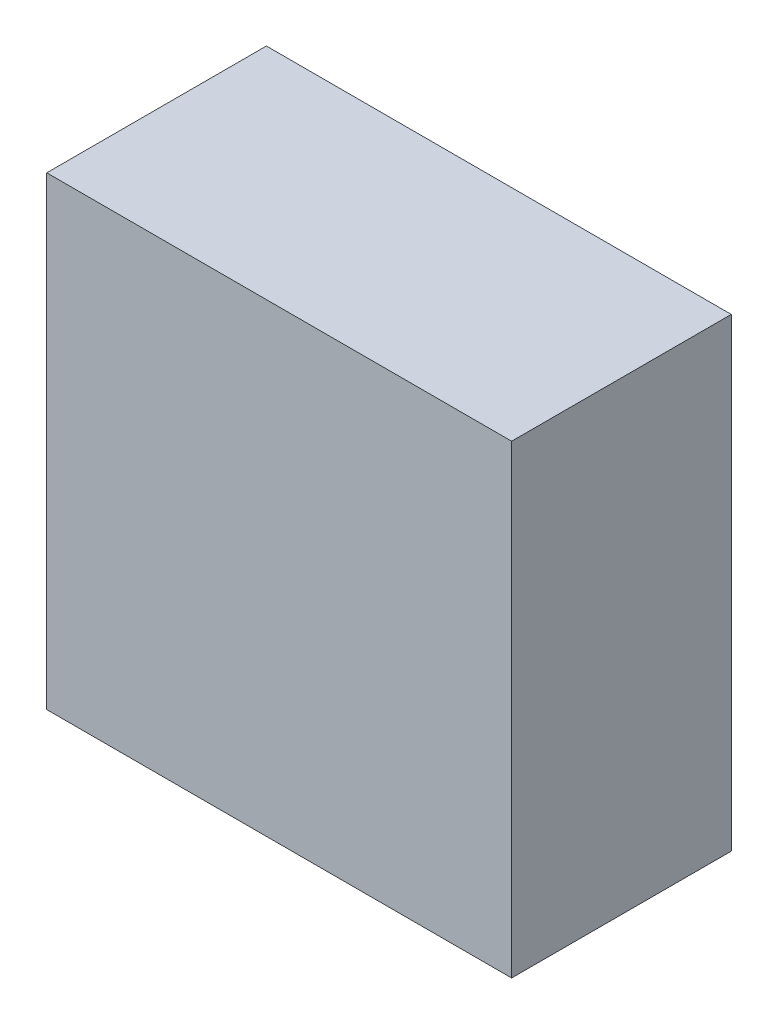
ISO-10303-21;
HEADER;
FILE_DESCRIPTION(('STEP AP214'),'2;1');
FILE_NAME('part.step','',(''),(''),'','','');
FILE_SCHEMA(('AUTOMOTIVE_DESIGN { 1 0 10303 214 1 1 1 1 }'));
ENDSEC;
DATA;
#1=APPLICATION_CONTEXT('core data for automotive mechanical design processes');
#2=APPLICATION_PROTOCOL_DEFINITION('international standard','automotive_design',2000,#1);
#3=PRODUCT_CONTEXT('',#1,'mechanical');
#4=PRODUCT('Part','Part','',(#3));
#5=PRODUCT_RELATED_PRODUCT_CATEGORY('part','',(#4));
#6=PRODUCT_DEFINITION_FORMATION('','',#4);
#7=PRODUCT_DEFINITION_CONTEXT('part definition',#1,'design');
#8=PRODUCT_DEFINITION('design','',#6,#7);
#9=PRODUCT_DEFINITION_SHAPE('','',#8);
#10=(LENGTH_UNIT() NAMED_UNIT(*) SI_UNIT(.MILLI.,.METRE.));
#11=(NAMED_UNIT(*) PLANE_ANGLE_UNIT() SI_UNIT($,.RADIAN.));
#12=(NAMED_UNIT(*) SI_UNIT($,.STERADIAN.) SOLID_ANGLE_UNIT());
#13=UNCERTAINTY_MEASURE_WITH_UNIT(LENGTH_MEASURE(1.E-05),#10,'distance_accuracy_value','');
#14=(GEOMETRIC_REPRESENTATION_CONTEXT(3) GLOBAL_UNCERTAINTY_ASSIGNED_CONTEXT((#13)) GLOBAL_UNIT_ASSIGNED_CONTEXT((#10,
#11,#12)) REPRESENTATION_CONTEXT('',''));
#15=CARTESIAN_POINT('',(0.,0.,0.));
#16=DIRECTION('',(0.,0.,1.));
#17=DIRECTION('',(1.,0.,0.));
#18=AXIS2_PLACEMENT_3D('',#15,#16,#17);
#19=CARTESIAN_POINT('',(-9.6495162385987,6.98598467880865,4.30903114393277));
#20=DIRECTION('',(1.,0.,0.));
#21=DIRECTION('',(0.,0.,-1.));
#22=AXIS2_PLACEMENT_3D('',#19,#20,#21);
#23=PLANE('',#22);
#24=DIRECTION('',(0.,-1.,0.));
#25=VECTOR('',#24,1.);
#26=CARTESIAN_POINT('',(-9.6495162385987,6.98598467880865,-1.69096885606723));
#27=LINE('',#26,#25);
#28=CARTESIAN_POINT('',(-9.6495162385987,6.98598467880865,-1.69096885606723));
#29=VERTEX_POINT('',#28);
#30=CARTESIAN_POINT('',(-9.6495162385987,-5.71401532119135,-1.69096885606723));
#31=VERTEX_POINT('',#30);
#32=EDGE_CURVE('E79',#29,#31,#27,.T.);
#33=ORIENTED_EDGE('',*,*,#32,.T.);
#34=DIRECTION('',(0.,0.,-1.));
#35=VECTOR('',#34,1.);
#36=CARTESIAN_POINT('',(-9.6495162385987,-5.71401532119135,4.30903114393277));
#37=LINE('',#36,#35);
#38=CARTESIAN_POINT('',(-9.6495162385987,-5.71401532119135,4.30903114393277));
#39=VERTEX_POINT('',#38);
#40=EDGE_CURVE('E11',#39,#31,#37,.T.);
#41=ORIENTED_EDGE('',*,*,#40,.F.);
#42=DIRECTION('',(0.,-1.,0.));
#43=VECTOR('',#42,1.);
#44=CARTESIAN_POINT('',(-9.6495162385987,6.98598467880865,4.30903114393277));
#45=LINE('',#44,#43);
#46=CARTESIAN_POINT('',(-9.6495162385987,6.98598467880865,4.30903114393277));
#47=VERTEX_POINT('',#46);
#48=EDGE_CURVE('E67',#47,#39,#45,.T.);
#49=ORIENTED_EDGE('',*,*,#48,.F.);
#50=DIRECTION('',(0.,0.,-1.));
#51=VECTOR('',#50,1.);
#52=CARTESIAN_POINT('',(-9.6495162385987,6.98598467880865,4.30903114393277));
#53=LINE('',#52,#51);
#54=EDGE_CURVE('E75',#47,#29,#53,.T.);
#55=ORIENTED_EDGE('',*,*,#54,.T.);
#56=EDGE_LOOP('',(#33,#41,#49,#55));
#57=FACE_BOUND('',#56,.T.);
#58=ADVANCED_FACE('F16',(#57),#23,.F.);
#59=CARTESIAN_POINT('',(-9.6495162385987,-5.71401532119135,4.30903114393277));
#60=DIRECTION('',(0.,1.,0.));
#61=DIRECTION('',(-1.,0.,0.));
#62=AXIS2_PLACEMENT_3D('',#59,#60,#61);
#63=PLANE('',#62);
#64=DIRECTION('',(1.,0.,0.));
#65=VECTOR('',#64,1.);
#66=CARTESIAN_POINT('',(-9.6495162385987,-5.71401532119135,-1.69096885606723));
#67=LINE('',#66,#65);
#68=CARTESIAN_POINT('',(3.0504837614013,-5.71401532119134,-1.69096885606723));
#69=VERTEX_POINT('',#68);
#70=EDGE_CURVE('E71',#31,#69,#67,.T.);
#71=ORIENTED_EDGE('',*,*,#70,.T.);
#72=DIRECTION('',(0.,0.,-1.));
#73=VECTOR('',#72,1.);
#74=CARTESIAN_POINT('',(3.0504837614013,-5.71401532119134,4.30903114393277));
#75=LINE('',#74,#73);
#76=CARTESIAN_POINT('',(3.0504837614013,-5.71401532119134,4.30903114393277));
#77=VERTEX_POINT('',#76);
#78=EDGE_CURVE('E24',#77,#69,#75,.T.);
#79=ORIENTED_EDGE('',*,*,#78,.F.);
#80=DIRECTION('',(1.,0.,0.));
#81=VECTOR('',#80,1.);
#82=CARTESIAN_POINT('',(-9.6495162385987,-5.71401532119135,4.30903114393277));
#83=LINE('',#82,#81);
#84=EDGE_CURVE('E62',#39,#77,#83,.T.);
#85=ORIENTED_EDGE('',*,*,#84,.F.);
#86=ORIENTED_EDGE('',*,*,#40,.T.);
#87=EDGE_LOOP('',(#71,#79,#85,#86));
#88=FACE_BOUND('',#87,.T.);
#89=ADVANCED_FACE('F70',(#88),#63,.F.);
#90=CARTESIAN_POINT('',(3.0504837614013,-5.71401532119134,4.30903114393277));
#91=DIRECTION('',(-1.,0.,0.));
#92=DIRECTION('',(0.,0.,1.));
#93=AXIS2_PLACEMENT_3D('',#90,#91,#92);
#94=PLANE('',#93);
#95=DIRECTION('',(0.,1.,0.));
#96=VECTOR('',#95,1.);
#97=CARTESIAN_POINT('',(3.0504837614013,-5.71401532119134,-1.69096885606723));
#98=LINE('',#97,#96);
#99=CARTESIAN_POINT('',(3.0504837614013,6.98598467880865,-1.69096885606723));
#100=VERTEX_POINT('',#99);
#101=EDGE_CURVE('E49',#69,#100,#98,.T.);
#102=ORIENTED_EDGE('',*,*,#101,.T.);
#103=DIRECTION('',(0.,0.,-1.));
#104=VECTOR('',#103,1.);
#105=CARTESIAN_POINT('',(3.0504837614013,6.98598467880865,4.30903114393277));
#106=LINE('',#105,#104);
#107=CARTESIAN_POINT('',(3.0504837614013,6.98598467880865,4.30903114393277));
#108=VERTEX_POINT('',#107);
#109=EDGE_CURVE('E72',#108,#100,#106,.T.);
#110=ORIENTED_EDGE('',*,*,#109,.F.);
#111=DIRECTION('',(0.,1.,0.));
#112=VECTOR('',#111,1.);
#113=CARTESIAN_POINT('',(3.0504837614013,-5.71401532119134,4.30903114393277));
#114=LINE('',#113,#112);
#115=EDGE_CURVE('E65',#77,#108,#114,.T.);
#116=ORIENTED_EDGE('',*,*,#115,.F.);
#117=ORIENTED_EDGE('',*,*,#78,.T.);
#118=EDGE_LOOP('',(#102,#110,#116,#117));
#119=FACE_BOUND('',#118,.T.);
#120=ADVANCED_FACE('F73',(#119),#94,.F.);
#121=CARTESIAN_POINT('',(3.0504837614013,6.98598467880865,4.30903114393277));
#122=DIRECTION('',(0.,-1.,0.));
#123=DIRECTION('',(1.,0.,0.));
#124=AXIS2_PLACEMENT_3D('',#121,#122,#123);
#125=PLANE('',#124);
#126=DIRECTION('',(-1.,0.,0.));
#127=VECTOR('',#126,1.);
#128=CARTESIAN_POINT('',(3.0504837614013,6.98598467880865,-1.69096885606723));
#129=LINE('',#128,#127);
#130=EDGE_CURVE('E55',#100,#29,#129,.T.);
#131=ORIENTED_EDGE('',*,*,#130,.T.);
#132=ORIENTED_EDGE('',*,*,#54,.F.);
#133=DIRECTION('',(-1.,0.,0.));
#134=VECTOR('',#133,1.);
#135=CARTESIAN_POINT('',(3.0504837614013,6.98598467880865,4.30903114393277));
#136=LINE('',#135,#134);
#137=EDGE_CURVE('E32',#108,#47,#136,.T.);
#138=ORIENTED_EDGE('',*,*,#137,.F.);
#139=ORIENTED_EDGE('',*,*,#109,.T.);
#140=EDGE_LOOP('',(#131,#132,#138,#139));
#141=FACE_BOUND('',#140,.T.);
#142=ADVANCED_FACE('F86',(#141),#125,.F.);
#143=CARTESIAN_POINT('',(-9.6495162385987,-5.71401532119135,4.30903114393277));
#144=DIRECTION('',(0.,0.,1.));
#145=DIRECTION('',(1.,0.,0.));
#146=AXIS2_PLACEMENT_3D('',#143,#144,#145);
#147=PLANE('',#146);
#148=ORIENTED_EDGE('',*,*,#48,.T.);
#149=ORIENTED_EDGE('',*,*,#84,.T.);
#150=ORIENTED_EDGE('',*,*,#115,.T.);
#151=ORIENTED_EDGE('',*,*,#137,.T.);
#152=EDGE_LOOP('',(#148,#149,#150,#151));
#153=FACE_BOUND('',#152,.T.);
#154=ADVANCED_FACE('F63',(#153),#147,.T.);
#155=CARTESIAN_POINT('',(-9.6495162385987,-5.71401532119135,-1.69096885606723));
#156=DIRECTION('',(0.,0.,1.));
#157=DIRECTION('',(1.,0.,0.));
#158=AXIS2_PLACEMENT_3D('',#155,#156,#157);
#159=PLANE('',#158);
#160=ORIENTED_EDGE('',*,*,#32,.F.);
#161=ORIENTED_EDGE('',*,*,#130,.F.);
#162=ORIENTED_EDGE('',*,*,#101,.F.);
#163=ORIENTED_EDGE('',*,*,#70,.F.);
#164=EDGE_LOOP('',(#160,#161,#162,#163));
#165=FACE_BOUND('',#164,.T.);
#166=ADVANCED_FACE('F89',(#165),#159,.F.);
#167=CLOSED_SHELL('',(#58,#89,#120,#142,#154,#166));
#168=MANIFOLD_SOLID_BREP('B1',#167);
#169=ADVANCED_BREP_SHAPE_REPRESENTATION('',(#18,#168),#14);
#170=SHAPE_DEFINITION_REPRESENTATION(#9,#169);
ENDSEC;
END-ISO-10303-21;
